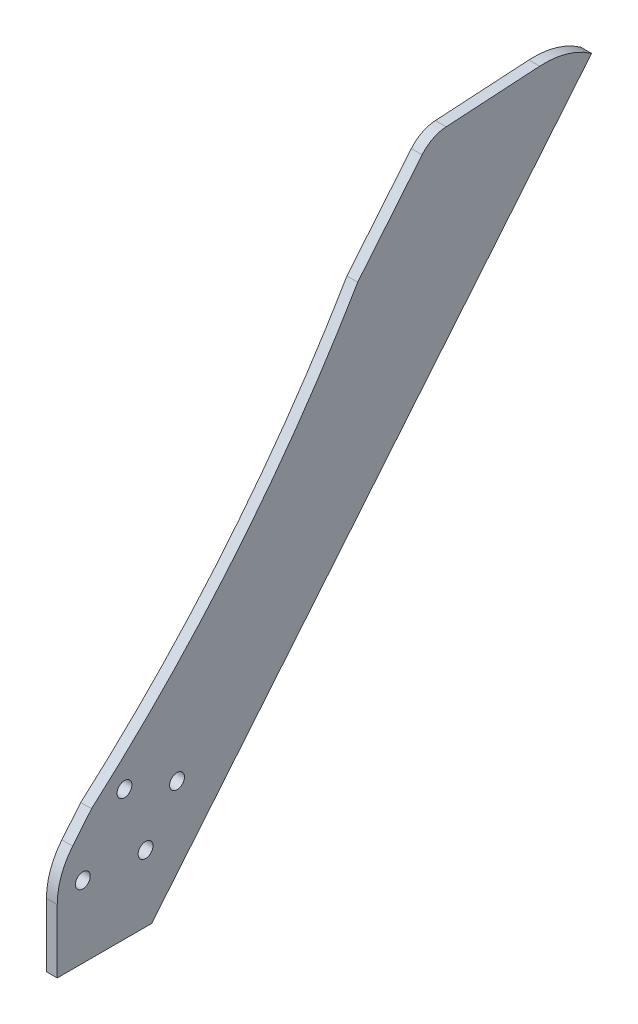
ISO-10303-21;
HEADER;
FILE_DESCRIPTION(('STEP AP214'),'2;1');
FILE_NAME('part.step','',(''),(''),'','','');
FILE_SCHEMA(('AUTOMOTIVE_DESIGN { 1 0 10303 214 1 1 1 1 }'));
ENDSEC;
DATA;
#1=APPLICATION_CONTEXT('core data for automotive mechanical design processes');
#2=APPLICATION_PROTOCOL_DEFINITION('international standard','automotive_design',2000,#1);
#3=PRODUCT_CONTEXT('',#1,'mechanical');
#4=PRODUCT('Part','Part','',(#3));
#5=PRODUCT_RELATED_PRODUCT_CATEGORY('part','',(#4));
#6=PRODUCT_DEFINITION_FORMATION('','',#4);
#7=PRODUCT_DEFINITION_CONTEXT('part definition',#1,'design');
#8=PRODUCT_DEFINITION('design','',#6,#7);
#9=PRODUCT_DEFINITION_SHAPE('','',#8);
#10=(LENGTH_UNIT() NAMED_UNIT(*) SI_UNIT(.MILLI.,.METRE.));
#11=(NAMED_UNIT(*) PLANE_ANGLE_UNIT() SI_UNIT($,.RADIAN.));
#12=(NAMED_UNIT(*) SI_UNIT($,.STERADIAN.) SOLID_ANGLE_UNIT());
#13=UNCERTAINTY_MEASURE_WITH_UNIT(LENGTH_MEASURE(1.E-05),#10,'distance_accuracy_value','');
#14=(GEOMETRIC_REPRESENTATION_CONTEXT(3) GLOBAL_UNCERTAINTY_ASSIGNED_CONTEXT((#13)) GLOBAL_UNIT_ASSIGNED_CONTEXT((#10,
#11,#12)) REPRESENTATION_CONTEXT('',''));
#15=CARTESIAN_POINT('',(0.,0.,0.));
#16=DIRECTION('',(0.,0.,1.));
#17=DIRECTION('',(1.,0.,0.));
#18=AXIS2_PLACEMENT_3D('',#15,#16,#17);
#19=CARTESIAN_POINT('',(-16.,1645.40423188423,1365.09288733945));
#20=DIRECTION('',(1.,0.,0.));
#21=DIRECTION('',(0.,0.,-1.));
#22=AXIS2_PLACEMENT_3D('',#19,#20,#21);
#23=CYLINDRICAL_SURFACE('',#22,1934.14773051193);
#24=CARTESIAN_POINT('',(0.,1645.40423188423,1365.09288733945));
#25=DIRECTION('',(-1.,0.,0.));
#26=DIRECTION('',(0.,0.,-1.));
#27=AXIS2_PLACEMENT_3D('',#24,#25,#26);
#28=CIRCLE('',#27,1934.14773051193);
#29=CARTESIAN_POINT('',(0.,670.218640107179,-305.21861206265));
#30=VERTEX_POINT('',#29);
#31=CARTESIAN_POINT('',(0.,191.855242318579,89.113742377779));
#32=VERTEX_POINT('',#31);
#33=EDGE_CURVE('E147',#30,#32,#28,.T.);
#34=ORIENTED_EDGE('',*,*,#33,.F.);
#35=DIRECTION('',(1.,0.,0.));
#36=VECTOR('',#35,1.);
#37=CARTESIAN_POINT('',(-16.,670.218640107179,-305.21861206265));
#38=LINE('',#37,#36);
#39=CARTESIAN_POINT('',(-16.,670.218640107179,-305.21861206265));
#40=VERTEX_POINT('',#39);
#41=EDGE_CURVE('E11',#40,#30,#38,.T.);
#42=ORIENTED_EDGE('',*,*,#41,.F.);
#43=CARTESIAN_POINT('',(-16.,1645.40423188423,1365.09288733945));
#44=DIRECTION('',(-1.,0.,0.));
#45=DIRECTION('',(0.,0.,-1.));
#46=AXIS2_PLACEMENT_3D('',#43,#44,#45);
#47=CIRCLE('',#46,1934.14773051193);
#48=CARTESIAN_POINT('',(-16.,191.855242318579,89.113742377779));
#49=VERTEX_POINT('',#48);
#50=EDGE_CURVE('E174',#40,#49,#47,.T.);
#51=ORIENTED_EDGE('',*,*,#50,.T.);
#52=DIRECTION('',(1.,0.,0.));
#53=VECTOR('',#52,1.);
#54=CARTESIAN_POINT('',(-16.,191.855242318579,89.113742377779));
#55=LINE('',#54,#53);
#56=EDGE_CURVE('E41',#49,#32,#55,.T.);
#57=ORIENTED_EDGE('',*,*,#56,.T.);
#58=EDGE_LOOP('',(#34,#42,#51,#57));
#59=FACE_BOUND('',#58,.T.);
#60=ADVANCED_FACE('F38',(#59),#23,.F.);
#61=CARTESIAN_POINT('',(-16.,670.218640107179,-305.21861206265));
#62=DIRECTION('',(0.,0.636078220277762,0.771624583387721));
#63=DIRECTION('',(0.,-0.771624583387721,0.636078220277762));
#64=AXIS2_PLACEMENT_3D('',#61,#62,#63);
#65=PLANE('',#64);
#66=DIRECTION('',(0.,-0.771624583387721,0.636078220277762));
#67=VECTOR('',#66,1.);
#68=CARTESIAN_POINT('',(0.,670.218640107179,-305.21861206265));
#69=LINE('',#68,#67);
#70=CARTESIAN_POINT('',(0.,785.962327615337,-400.630345104315));
#71=VERTEX_POINT('',#70);
#72=EDGE_CURVE('E172',#71,#30,#69,.T.);
#73=ORIENTED_EDGE('',*,*,#72,.F.);
#74=DIRECTION('',(1.,0.,0.));
#75=VECTOR('',#74,1.);
#76=CARTESIAN_POINT('',(-16.,785.962327615337,-400.630345104315));
#77=LINE('',#76,#75);
#78=CARTESIAN_POINT('',(-16.,785.962327615337,-400.630345104315));
#79=VERTEX_POINT('',#78);
#80=EDGE_CURVE('E47',#79,#71,#77,.T.);
#81=ORIENTED_EDGE('',*,*,#80,.F.);
#82=DIRECTION('',(0.,-0.771624583387721,0.636078220277762));
#83=VECTOR('',#82,1.);
#84=CARTESIAN_POINT('',(-16.,670.218640107179,-305.21861206265));
#85=LINE('',#84,#83);
#86=EDGE_CURVE('E137',#79,#40,#85,.T.);
#87=ORIENTED_EDGE('',*,*,#86,.T.);
#88=ORIENTED_EDGE('',*,*,#41,.T.);
#89=EDGE_LOOP('',(#73,#81,#87,#88));
#90=FACE_BOUND('',#89,.T.);
#91=ADVANCED_FACE('F190',(#90),#65,.T.);
#92=CARTESIAN_POINT('',(-16.,754.158416603288,-439.211574271469));
#93=DIRECTION('',(1.,0.,0.));
#94=DIRECTION('',(0.,0.,-1.));
#95=AXIS2_PLACEMENT_3D('',#92,#93,#94);
#96=CYLINDRICAL_SURFACE('',#95,49.9999999971077);
#97=CARTESIAN_POINT('',(0.,754.158416603288,-439.211574271469));
#98=DIRECTION('',(1.,0.,0.));
#99=DIRECTION('',(0.,0.,-1.));
#100=AXIS2_PLACEMENT_3D('',#97,#98,#99);
#101=CIRCLE('',#100,49.9999999971077);
#102=CARTESIAN_POINT('',(0.,804.065156521495,-436.159147294902));
#103=VERTEX_POINT('',#102);
#104=EDGE_CURVE('E124',#103,#71,#101,.T.);
#105=ORIENTED_EDGE('',*,*,#104,.F.);
#106=DIRECTION('',(1.,0.,0.));
#107=VECTOR('',#106,1.);
#108=CARTESIAN_POINT('',(-16.,804.065156521495,-436.159147294902));
#109=LINE('',#108,#107);
#110=CARTESIAN_POINT('',(-16.,804.065156521495,-436.159147294902));
#111=VERTEX_POINT('',#110);
#112=EDGE_CURVE('E119',#111,#103,#109,.T.);
#113=ORIENTED_EDGE('',*,*,#112,.F.);
#114=CARTESIAN_POINT('',(-16.,754.158416603288,-439.211574271469));
#115=DIRECTION('',(1.,0.,0.));
#116=DIRECTION('',(0.,0.,-1.));
#117=AXIS2_PLACEMENT_3D('',#114,#115,#116);
#118=CIRCLE('',#117,49.9999999971077);
#119=EDGE_CURVE('E122',#111,#79,#118,.T.);
#120=ORIENTED_EDGE('',*,*,#119,.T.);
#121=ORIENTED_EDGE('',*,*,#80,.T.);
#122=EDGE_LOOP('',(#105,#113,#120,#121));
#123=FACE_BOUND('',#122,.T.);
#124=ADVANCED_FACE('F121',(#123),#96,.T.);
#125=CARTESIAN_POINT('',(-16.,804.065156521495,-436.159147294902));
#126=DIRECTION('',(0.,0.998134798421866,0.0610485395348636));
#127=DIRECTION('',(0.,-0.0610485395348637,0.998134798421867));
#128=AXIS2_PLACEMENT_3D('',#125,#126,#127);
#129=PLANE('',#128);
#130=DIRECTION('',(0.,-0.0610485395348636,0.998134798421866));
#131=VECTOR('',#130,1.);
#132=CARTESIAN_POINT('',(0.,804.065156521495,-436.159147294902));
#133=LINE('',#132,#131);
#134=CARTESIAN_POINT('',(0.,812.541744434729,-574.750134606718));
#135=VERTEX_POINT('',#134);
#136=EDGE_CURVE('E169',#135,#103,#133,.T.);
#137=ORIENTED_EDGE('',*,*,#136,.F.);
#138=DIRECTION('',(1.,0.,0.));
#139=VECTOR('',#138,1.);
#140=CARTESIAN_POINT('',(-16.,812.541744434729,-574.750134606718));
#141=LINE('',#140,#139);
#142=CARTESIAN_POINT('',(-16.,812.541744434729,-574.750134606718));
#143=VERTEX_POINT('',#142);
#144=EDGE_CURVE('E129',#143,#135,#141,.T.);
#145=ORIENTED_EDGE('',*,*,#144,.F.);
#146=DIRECTION('',(0.,-0.0610485395348636,0.998134798421866));
#147=VECTOR('',#146,1.);
#148=CARTESIAN_POINT('',(-16.,804.065156521495,-436.159147294902));
#149=LINE('',#148,#147);
#150=EDGE_CURVE('E135',#143,#111,#149,.T.);
#151=ORIENTED_EDGE('',*,*,#150,.T.);
#152=ORIENTED_EDGE('',*,*,#112,.T.);
#153=EDGE_LOOP('',(#137,#145,#151,#152));
#154=FACE_BOUND('',#153,.T.);
#155=ADVANCED_FACE('F139',(#154),#129,.T.);
#156=CARTESIAN_POINT('',(-16.,692.765568624105,-582.075959350902));
#157=DIRECTION('',(1.,0.,0.));
#158=DIRECTION('',(0.,0.,-1.));
#159=AXIS2_PLACEMENT_3D('',#156,#157,#158);
#160=CYLINDRICAL_SURFACE('',#159,120.);
#161=CARTESIAN_POINT('',(0.,692.765568624105,-582.075959350902));
#162=DIRECTION('',(1.,0.,0.));
#163=DIRECTION('',(0.,0.,-1.));
#164=AXIS2_PLACEMENT_3D('',#161,#162,#163);
#165=CIRCLE('',#164,120.);
#166=CARTESIAN_POINT('',(0.,790.529385680721,-651.662136674567));
#167=VERTEX_POINT('',#166);
#168=EDGE_CURVE('E166',#167,#135,#165,.T.);
#169=ORIENTED_EDGE('',*,*,#168,.F.);
#170=DIRECTION('',(1.,0.,0.));
#171=VECTOR('',#170,1.);
#172=CARTESIAN_POINT('',(-16.,790.529385680721,-651.662136674567));
#173=LINE('',#172,#171);
#174=CARTESIAN_POINT('',(-16.,790.529385680721,-651.662136674567));
#175=VERTEX_POINT('',#174);
#176=EDGE_CURVE('E178',#175,#167,#173,.T.);
#177=ORIENTED_EDGE('',*,*,#176,.F.);
#178=CARTESIAN_POINT('',(-16.,692.765568624105,-582.075959350902));
#179=DIRECTION('',(1.,0.,0.));
#180=DIRECTION('',(0.,0.,-1.));
#181=AXIS2_PLACEMENT_3D('',#178,#179,#180);
#182=CIRCLE('',#181,120.);
#183=EDGE_CURVE('E140',#175,#143,#182,.T.);
#184=ORIENTED_EDGE('',*,*,#183,.T.);
#185=ORIENTED_EDGE('',*,*,#144,.T.);
#186=EDGE_LOOP('',(#169,#177,#184,#185));
#187=FACE_BOUND('',#186,.T.);
#188=ADVANCED_FACE('F203',(#187),#160,.T.);
#189=CARTESIAN_POINT('',(-16.,790.529385680721,-651.662136674567));
#190=DIRECTION('',(0.,-0.636078220277762,-0.771624583387722));
#191=DIRECTION('',(0.,0.771624583387721,-0.636078220277762));
#192=AXIS2_PLACEMENT_3D('',#189,#190,#191);
#193=PLANE('',#192);
#194=DIRECTION('',(0.,0.771624583387722,-0.636078220277762));
#195=VECTOR('',#194,1.);
#196=CARTESIAN_POINT('',(0.,790.529385680721,-651.662136674567));
#197=LINE('',#196,#195);
#198=CARTESIAN_POINT('',(0.,0.,0.));
#199=VERTEX_POINT('',#198);
#200=EDGE_CURVE('E163',#199,#167,#197,.T.);
#201=ORIENTED_EDGE('',*,*,#200,.F.);
#202=DIRECTION('',(1.,0.,0.));
#203=VECTOR('',#202,1.);
#204=CARTESIAN_POINT('',(-16.,0.,0.));
#205=LINE('',#204,#203);
#206=CARTESIAN_POINT('',(-16.,0.,0.));
#207=VERTEX_POINT('',#206);
#208=EDGE_CURVE('E180',#207,#199,#205,.T.);
#209=ORIENTED_EDGE('',*,*,#208,.F.);
#210=DIRECTION('',(0.,0.771624583387722,-0.636078220277762));
#211=VECTOR('',#210,1.);
#212=CARTESIAN_POINT('',(-16.,790.529385680721,-651.662136674567));
#213=LINE('',#212,#211);
#214=EDGE_CURVE('E142',#207,#175,#213,.T.);
#215=ORIENTED_EDGE('',*,*,#214,.T.);
#216=ORIENTED_EDGE('',*,*,#176,.T.);
#217=EDGE_LOOP('',(#201,#209,#215,#216));
#218=FACE_BOUND('',#217,.T.);
#219=ADVANCED_FACE('F206',(#218),#193,.T.);
#220=CARTESIAN_POINT('',(-16.,0.,0.));
#221=DIRECTION('',(0.,-1.,0.));
#222=DIRECTION('',(0.,0.,-1.));
#223=AXIS2_PLACEMENT_3D('',#220,#221,#222);
#224=PLANE('',#223);
#225=DIRECTION('',(0.,0.,-1.));
#226=VECTOR('',#225,1.);
#227=CARTESIAN_POINT('',(0.,0.,0.));
#228=LINE('',#227,#226);
#229=CARTESIAN_POINT('',(0.,0.,140.));
#230=VERTEX_POINT('',#229);
#231=EDGE_CURVE('E160',#230,#199,#228,.T.);
#232=ORIENTED_EDGE('',*,*,#231,.F.);
#233=DIRECTION('',(1.,0.,0.));
#234=VECTOR('',#233,1.);
#235=CARTESIAN_POINT('',(-16.,0.,140.));
#236=LINE('',#235,#234);
#237=CARTESIAN_POINT('',(-16.,0.,140.));
#238=VERTEX_POINT('',#237);
#239=EDGE_CURVE('E182',#238,#230,#236,.T.);
#240=ORIENTED_EDGE('',*,*,#239,.F.);
#241=DIRECTION('',(0.,0.,-1.));
#242=VECTOR('',#241,1.);
#243=CARTESIAN_POINT('',(-16.,0.,0.));
#244=LINE('',#243,#242);
#245=EDGE_CURVE('E286',#238,#207,#244,.T.);
#246=ORIENTED_EDGE('',*,*,#245,.T.);
#247=ORIENTED_EDGE('',*,*,#208,.T.);
#248=EDGE_LOOP('',(#232,#240,#246,#247));
#249=FACE_BOUND('',#248,.T.);
#250=ADVANCED_FACE('F210',(#249),#224,.T.);
#251=CARTESIAN_POINT('',(-16.,0.,140.));
#252=DIRECTION('',(0.,0.,1.));
#253=DIRECTION('',(1.,0.,0.));
#254=AXIS2_PLACEMENT_3D('',#251,#252,#253);
#255=PLANE('',#254);
#256=DIRECTION('',(0.,-1.,0.));
#257=VECTOR('',#256,1.);
#258=CARTESIAN_POINT('',(0.,0.,140.));
#259=LINE('',#258,#257);
#260=CARTESIAN_POINT('',(0.,94.2216069898681,140.));
#261=VERTEX_POINT('',#260);
#262=EDGE_CURVE('E157',#261,#230,#259,.T.);
#263=ORIENTED_EDGE('',*,*,#262,.F.);
#264=DIRECTION('',(1.,0.,0.));
#265=VECTOR('',#264,1.);
#266=CARTESIAN_POINT('',(-16.,94.2216069898681,140.));
#267=LINE('',#266,#265);
#268=CARTESIAN_POINT('',(-16.,94.2216069898681,140.));
#269=VERTEX_POINT('',#268);
#270=EDGE_CURVE('E184',#269,#261,#267,.T.);
#271=ORIENTED_EDGE('',*,*,#270,.F.);
#272=DIRECTION('',(0.,-1.,0.));
#273=VECTOR('',#272,1.);
#274=CARTESIAN_POINT('',(-16.,0.,140.));
#275=LINE('',#274,#273);
#276=EDGE_CURVE('E283',#269,#238,#275,.T.);
#277=ORIENTED_EDGE('',*,*,#276,.T.);
#278=ORIENTED_EDGE('',*,*,#239,.T.);
#279=EDGE_LOOP('',(#263,#271,#277,#278));
#280=FACE_BOUND('',#279,.T.);
#281=ADVANCED_FACE('F214',(#280),#255,.T.);
#282=CARTESIAN_POINT('',(-16.,94.2216069898681,40.));
#283=DIRECTION('',(1.,0.,0.));
#284=DIRECTION('',(0.,0.,-1.));
#285=AXIS2_PLACEMENT_3D('',#282,#283,#284);
#286=CYLINDRICAL_SURFACE('',#285,100.);
#287=CARTESIAN_POINT('',(0.,94.2216069898681,40.));
#288=DIRECTION('',(1.,0.,0.));
#289=DIRECTION('',(0.,0.,1.));
#290=AXIS2_PLACEMENT_3D('',#287,#288,#289);
#291=CIRCLE('',#290,100.);
#292=CARTESIAN_POINT('',(0.,157.829429017644,117.162458338772));
#293=VERTEX_POINT('',#292);
#294=EDGE_CURVE('E154',#293,#261,#291,.T.);
#295=ORIENTED_EDGE('',*,*,#294,.F.);
#296=DIRECTION('',(1.,0.,0.));
#297=VECTOR('',#296,1.);
#298=CARTESIAN_POINT('',(-16.,157.829429017644,117.162458338772));
#299=LINE('',#298,#297);
#300=CARTESIAN_POINT('',(-16.,157.829429017644,117.162458338772));
#301=VERTEX_POINT('',#300);
#302=EDGE_CURVE('E185',#301,#293,#299,.T.);
#303=ORIENTED_EDGE('',*,*,#302,.F.);
#304=CARTESIAN_POINT('',(-16.,94.2216069898681,40.));
#305=DIRECTION('',(1.,0.,0.));
#306=DIRECTION('',(0.,0.,1.));
#307=AXIS2_PLACEMENT_3D('',#304,#305,#306);
#308=CIRCLE('',#307,100.);
#309=EDGE_CURVE('E280',#301,#269,#308,.T.);
#310=ORIENTED_EDGE('',*,*,#309,.T.);
#311=ORIENTED_EDGE('',*,*,#270,.T.);
#312=EDGE_LOOP('',(#295,#303,#310,#311));
#313=FACE_BOUND('',#312,.T.);
#314=ADVANCED_FACE('F218',(#313),#286,.T.);
#315=CARTESIAN_POINT('',(-16.,157.829429017644,117.162458338772));
#316=DIRECTION('',(0.,0.636078220277763,0.771624583387721));
#317=DIRECTION('',(0.,-0.771624583387721,0.636078220277763));
#318=AXIS2_PLACEMENT_3D('',#315,#316,#317);
#319=PLANE('',#318);
#320=DIRECTION('',(0.,-0.771624583387721,0.636078220277763));
#321=VECTOR('',#320,1.);
#322=CARTESIAN_POINT('',(0.,157.829429017644,117.162458338772));
#323=LINE('',#322,#321);
#324=EDGE_CURVE('E150',#32,#293,#323,.T.);
#325=ORIENTED_EDGE('',*,*,#324,.F.);
#326=ORIENTED_EDGE('',*,*,#56,.F.);
#327=DIRECTION('',(0.,-0.771624583387721,0.636078220277763));
#328=VECTOR('',#327,1.);
#329=CARTESIAN_POINT('',(-16.,157.829429017644,117.162458338772));
#330=LINE('',#329,#328);
#331=EDGE_CURVE('E278',#49,#301,#330,.T.);
#332=ORIENTED_EDGE('',*,*,#331,.T.);
#333=ORIENTED_EDGE('',*,*,#302,.T.);
#334=EDGE_LOOP('',(#325,#326,#332,#333));
#335=FACE_BOUND('',#334,.T.);
#336=ADVANCED_FACE('F187',(#335),#319,.T.);
#337=CARTESIAN_POINT('',(-16.,1645.40423188423,1365.09288733945));
#338=DIRECTION('',(1.,0.,0.));
#339=DIRECTION('',(0.,0.,-1.));
#340=AXIS2_PLACEMENT_3D('',#337,#338,#339);
#341=PLANE('',#340);
#342=CARTESIAN_POINT('',(-16.,163.846890742229,-37.4978752643633));
#343=DIRECTION('',(1.,0.,0.));
#344=DIRECTION('',(0.,0.,-1.));
#345=AXIS2_PLACEMENT_3D('',#342,#343,#344);
#346=CIRCLE('',#345,10.9999999999999);
#347=CARTESIAN_POINT('',(-16.,163.846890742229,-48.4978752643632));
#348=VERTEX_POINT('',#347);
#349=EDGE_CURVE('E253',#348,#348,#346,.T.);
#350=ORIENTED_EDGE('',*,*,#349,.T.);
#351=EDGE_LOOP('',(#350));
#352=FACE_BOUND('',#351,.T.);
#353=CARTESIAN_POINT('',(-16.,98.8189119881103,9.10000000000001));
#354=DIRECTION('',(1.,0.,0.));
#355=DIRECTION('',(0.,0.,-1.));
#356=AXIS2_PLACEMENT_3D('',#353,#354,#355);
#357=CIRCLE('',#356,11.);
#358=CARTESIAN_POINT('',(-16.,98.8189119881103,-1.9));
#359=VERTEX_POINT('',#358);
#360=EDGE_CURVE('E261',#359,#359,#357,.T.);
#361=ORIENTED_EDGE('',*,*,#360,.T.);
#362=EDGE_LOOP('',(#361));
#363=FACE_BOUND('',#362,.T.);
#364=CARTESIAN_POINT('',(-16.,106.4,102.086703912742));
#365=DIRECTION('',(1.,0.,0.));
#366=DIRECTION('',(0.,0.,-1.));
#367=AXIS2_PLACEMENT_3D('',#364,#365,#366);
#368=CIRCLE('',#367,11.);
#369=CARTESIAN_POINT('',(-16.,106.4,91.0867039127424));
#370=VERTEX_POINT('',#369);
#371=EDGE_CURVE('E267',#370,#370,#368,.T.);
#372=ORIENTED_EDGE('',*,*,#371,.T.);
#373=EDGE_LOOP('',(#372));
#374=FACE_BOUND('',#373,.T.);
#375=CARTESIAN_POINT('',(-16.,192.56207184921,40.3445191874617));
#376=DIRECTION('',(1.,0.,0.));
#377=DIRECTION('',(0.,0.,-1.));
#378=AXIS2_PLACEMENT_3D('',#375,#376,#377);
#379=CIRCLE('',#378,11.);
#380=CARTESIAN_POINT('',(-16.,192.56207184921,29.3445191874616));
#381=VERTEX_POINT('',#380);
#382=EDGE_CURVE('E151',#381,#381,#379,.T.);
#383=ORIENTED_EDGE('',*,*,#382,.T.);
#384=EDGE_LOOP('',(#383));
#385=FACE_BOUND('',#384,.T.);
#386=ORIENTED_EDGE('',*,*,#50,.F.);
#387=ORIENTED_EDGE('',*,*,#86,.F.);
#388=ORIENTED_EDGE('',*,*,#119,.F.);
#389=ORIENTED_EDGE('',*,*,#150,.F.);
#390=ORIENTED_EDGE('',*,*,#183,.F.);
#391=ORIENTED_EDGE('',*,*,#214,.F.);
#392=ORIENTED_EDGE('',*,*,#245,.F.);
#393=ORIENTED_EDGE('',*,*,#276,.F.);
#394=ORIENTED_EDGE('',*,*,#309,.F.);
#395=ORIENTED_EDGE('',*,*,#331,.F.);
#396=EDGE_LOOP('',(#386,#387,#388,#389,#390,#391,#392,#393,#394,#395));
#397=FACE_BOUND('',#396,.T.);
#398=ADVANCED_FACE('F133',(#352,#363,#374,#385,#397),#341,.F.);
#399=CARTESIAN_POINT('',(0.,1645.40423188423,1365.09288733945));
#400=DIRECTION('',(1.,0.,0.));
#401=DIRECTION('',(0.,0.,-1.));
#402=AXIS2_PLACEMENT_3D('',#399,#400,#401);
#403=PLANE('',#402);
#404=CARTESIAN_POINT('',(0.,163.846890742229,-37.4978752643633));
#405=DIRECTION('',(1.,0.,0.));
#406=DIRECTION('',(0.,0.,-1.));
#407=AXIS2_PLACEMENT_3D('',#404,#405,#406);
#408=CIRCLE('',#407,10.9999999999999);
#409=CARTESIAN_POINT('',(0.,163.846890742229,-48.4978752643632));
#410=VERTEX_POINT('',#409);
#411=EDGE_CURVE('E256',#410,#410,#408,.T.);
#412=ORIENTED_EDGE('',*,*,#411,.F.);
#413=EDGE_LOOP('',(#412));
#414=FACE_BOUND('',#413,.T.);
#415=CARTESIAN_POINT('',(0.,98.8189119881103,9.10000000000001));
#416=DIRECTION('',(1.,0.,0.));
#417=DIRECTION('',(0.,0.,-1.));
#418=AXIS2_PLACEMENT_3D('',#415,#416,#417);
#419=CIRCLE('',#418,11.);
#420=CARTESIAN_POINT('',(0.,98.8189119881103,-1.9));
#421=VERTEX_POINT('',#420);
#422=EDGE_CURVE('E258',#421,#421,#419,.T.);
#423=ORIENTED_EDGE('',*,*,#422,.F.);
#424=EDGE_LOOP('',(#423));
#425=FACE_BOUND('',#424,.T.);
#426=CARTESIAN_POINT('',(0.,106.4,102.086703912742));
#427=DIRECTION('',(1.,0.,0.));
#428=DIRECTION('',(0.,0.,-1.));
#429=AXIS2_PLACEMENT_3D('',#426,#427,#428);
#430=CIRCLE('',#429,11.);
#431=CARTESIAN_POINT('',(0.,106.4,91.0867039127424));
#432=VERTEX_POINT('',#431);
#433=EDGE_CURVE('E264',#432,#432,#430,.T.);
#434=ORIENTED_EDGE('',*,*,#433,.F.);
#435=EDGE_LOOP('',(#434));
#436=FACE_BOUND('',#435,.T.);
#437=CARTESIAN_POINT('',(0.,192.56207184921,40.3445191874617));
#438=DIRECTION('',(1.,0.,0.));
#439=DIRECTION('',(0.,0.,-1.));
#440=AXIS2_PLACEMENT_3D('',#437,#438,#439);
#441=CIRCLE('',#440,11.);
#442=CARTESIAN_POINT('',(0.,192.56207184921,29.3445191874616));
#443=VERTEX_POINT('',#442);
#444=EDGE_CURVE('E270',#443,#443,#441,.T.);
#445=ORIENTED_EDGE('',*,*,#444,.F.);
#446=EDGE_LOOP('',(#445));
#447=FACE_BOUND('',#446,.T.);
#448=ORIENTED_EDGE('',*,*,#33,.T.);
#449=ORIENTED_EDGE('',*,*,#324,.T.);
#450=ORIENTED_EDGE('',*,*,#294,.T.);
#451=ORIENTED_EDGE('',*,*,#262,.T.);
#452=ORIENTED_EDGE('',*,*,#231,.T.);
#453=ORIENTED_EDGE('',*,*,#200,.T.);
#454=ORIENTED_EDGE('',*,*,#168,.T.);
#455=ORIENTED_EDGE('',*,*,#136,.T.);
#456=ORIENTED_EDGE('',*,*,#104,.T.);
#457=ORIENTED_EDGE('',*,*,#72,.T.);
#458=EDGE_LOOP('',(#448,#449,#450,#451,#452,#453,#454,#455,#456,#457));
#459=FACE_BOUND('',#458,.T.);
#460=ADVANCED_FACE('F189',(#414,#425,#436,#447,#459),#403,.T.);
#461=CARTESIAN_POINT('',(-16.,192.56207184921,40.3445191874617));
#462=DIRECTION('',(1.,0.,0.));
#463=DIRECTION('',(0.,0.,-1.));
#464=AXIS2_PLACEMENT_3D('',#461,#462,#463);
#465=CYLINDRICAL_SURFACE('',#464,11.);
#466=ORIENTED_EDGE('',*,*,#382,.F.);
#467=EDGE_LOOP('',(#466));
#468=FACE_BOUND('',#467,.T.);
#469=ORIENTED_EDGE('',*,*,#444,.T.);
#470=EDGE_LOOP('',(#469));
#471=FACE_BOUND('',#470,.T.);
#472=ADVANCED_FACE('F230',(#468,#471),#465,.F.);
#473=CARTESIAN_POINT('',(-16.,106.4,102.086703912742));
#474=DIRECTION('',(1.,0.,0.));
#475=DIRECTION('',(0.,0.,-1.));
#476=AXIS2_PLACEMENT_3D('',#473,#474,#475);
#477=CYLINDRICAL_SURFACE('',#476,11.);
#478=ORIENTED_EDGE('',*,*,#371,.F.);
#479=EDGE_LOOP('',(#478));
#480=FACE_BOUND('',#479,.T.);
#481=ORIENTED_EDGE('',*,*,#433,.T.);
#482=EDGE_LOOP('',(#481));
#483=FACE_BOUND('',#482,.T.);
#484=ADVANCED_FACE('F237',(#480,#483),#477,.F.);
#485=CARTESIAN_POINT('',(-16.,98.8189119881103,9.10000000000001));
#486=DIRECTION('',(1.,0.,0.));
#487=DIRECTION('',(0.,0.,-1.));
#488=AXIS2_PLACEMENT_3D('',#485,#486,#487);
#489=CYLINDRICAL_SURFACE('',#488,11.);
#490=ORIENTED_EDGE('',*,*,#360,.F.);
#491=EDGE_LOOP('',(#490));
#492=FACE_BOUND('',#491,.T.);
#493=ORIENTED_EDGE('',*,*,#422,.T.);
#494=EDGE_LOOP('',(#493));
#495=FACE_BOUND('',#494,.T.);
#496=ADVANCED_FACE('F241',(#492,#495),#489,.F.);
#497=CARTESIAN_POINT('',(-16.,163.846890742229,-37.4978752643633));
#498=DIRECTION('',(1.,0.,0.));
#499=DIRECTION('',(0.,0.,-1.));
#500=AXIS2_PLACEMENT_3D('',#497,#498,#499);
#501=CYLINDRICAL_SURFACE('',#500,10.9999999999999);
#502=ORIENTED_EDGE('',*,*,#349,.F.);
#503=EDGE_LOOP('',(#502));
#504=FACE_BOUND('',#503,.T.);
#505=ORIENTED_EDGE('',*,*,#411,.T.);
#506=EDGE_LOOP('',(#505));
#507=FACE_BOUND('',#506,.T.);
#508=ADVANCED_FACE('F245',(#504,#507),#501,.F.);
#509=CLOSED_SHELL('',(#60,#91,#124,#155,#188,#219,#250,#281,#314,#336,#398,#460,#472,#484,#496,#508));
#510=MANIFOLD_SOLID_BREP('B2',#509);
#511=ADVANCED_BREP_SHAPE_REPRESENTATION('',(#18,#510),#14);
#512=SHAPE_DEFINITION_REPRESENTATION(#9,#511);
ENDSEC;
END-ISO-10303-21;
